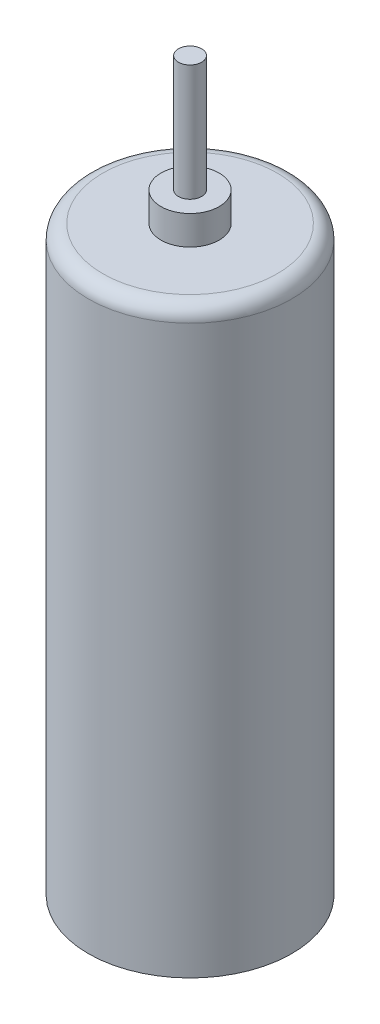
ISO-10303-21;
HEADER;
FILE_DESCRIPTION(('STEP AP214'),'2;1');
FILE_NAME('part.step','',(''),(''),'','','');
FILE_SCHEMA(('AUTOMOTIVE_DESIGN { 1 0 10303 214 1 1 1 1 }'));
ENDSEC;
DATA;
#1=APPLICATION_CONTEXT('core data for automotive mechanical design processes');
#2=APPLICATION_PROTOCOL_DEFINITION('international standard','automotive_design',2000,#1);
#3=PRODUCT_CONTEXT('',#1,'mechanical');
#4=PRODUCT('Part','Part','',(#3));
#5=PRODUCT_RELATED_PRODUCT_CATEGORY('part','',(#4));
#6=PRODUCT_DEFINITION_FORMATION('','',#4);
#7=PRODUCT_DEFINITION_CONTEXT('part definition',#1,'design');
#8=PRODUCT_DEFINITION('design','',#6,#7);
#9=PRODUCT_DEFINITION_SHAPE('','',#8);
#10=(LENGTH_UNIT() NAMED_UNIT(*) SI_UNIT(.MILLI.,.METRE.));
#11=(NAMED_UNIT(*) PLANE_ANGLE_UNIT() SI_UNIT($,.RADIAN.));
#12=(NAMED_UNIT(*) SI_UNIT($,.STERADIAN.) SOLID_ANGLE_UNIT());
#13=UNCERTAINTY_MEASURE_WITH_UNIT(LENGTH_MEASURE(1.E-05),#10,'distance_accuracy_value','');
#14=(GEOMETRIC_REPRESENTATION_CONTEXT(3) GLOBAL_UNCERTAINTY_ASSIGNED_CONTEXT((#13)) GLOBAL_UNIT_ASSIGNED_CONTEXT((#10,
#11,#12)) REPRESENTATION_CONTEXT('',''));
#15=CARTESIAN_POINT('',(0.,0.,0.));
#16=DIRECTION('',(0.,0.,1.));
#17=DIRECTION('',(1.,0.,0.));
#18=AXIS2_PLACEMENT_3D('',#15,#16,#17);
#19=CARTESIAN_POINT('',(0.,20.,0.));
#20=DIRECTION('',(0.,-1.,0.));
#21=DIRECTION('',(0.,0.,-1.));
#22=AXIS2_PLACEMENT_3D('',#19,#20,#21);
#23=CYLINDRICAL_SURFACE('',#22,3.5);
#24=CARTESIAN_POINT('',(0.,19.5,0.));
#25=DIRECTION('',(0.,1.,0.));
#26=DIRECTION('',(0.,0.,1.));
#27=AXIS2_PLACEMENT_3D('',#24,#25,#26);
#28=CIRCLE('',#27,3.5);
#29=CARTESIAN_POINT('',(0.,19.5,3.5));
#30=VERTEX_POINT('',#29);
#31=EDGE_CURVE('E10',#30,#30,#28,.F.);
#32=ORIENTED_EDGE('',*,*,#31,.T.);
#33=EDGE_LOOP('',(#32));
#34=FACE_BOUND('',#33,.T.);
#35=CARTESIAN_POINT('',(0.,0.,0.));
#36=DIRECTION('',(0.,1.,0.));
#37=DIRECTION('',(0.,0.,1.));
#38=AXIS2_PLACEMENT_3D('',#35,#36,#37);
#39=CIRCLE('',#38,3.5);
#40=CARTESIAN_POINT('',(0.,0.,3.5));
#41=VERTEX_POINT('',#40);
#42=EDGE_CURVE('E55',#41,#41,#39,.T.);
#43=ORIENTED_EDGE('',*,*,#42,.T.);
#44=EDGE_LOOP('',(#43));
#45=FACE_BOUND('',#44,.T.);
#46=ADVANCED_FACE('F37',(#34,#45),#23,.T.);
#47=CARTESIAN_POINT('',(0.,20.,0.));
#48=DIRECTION('',(0.,1.,0.));
#49=DIRECTION('',(0.,0.,1.));
#50=AXIS2_PLACEMENT_3D('',#47,#48,#49);
#51=PLANE('',#50);
#52=CARTESIAN_POINT('',(0.,20.,0.));
#53=DIRECTION('',(0.,1.,0.));
#54=DIRECTION('',(0.,0.,1.));
#55=AXIS2_PLACEMENT_3D('',#52,#53,#54);
#56=CIRCLE('',#55,3.);
#57=CARTESIAN_POINT('',(0.,20.,3.));
#58=VERTEX_POINT('',#57);
#59=EDGE_CURVE('E45',#58,#58,#56,.T.);
#60=ORIENTED_EDGE('',*,*,#59,.T.);
#61=EDGE_LOOP('',(#60));
#62=FACE_BOUND('',#61,.T.);
#63=CARTESIAN_POINT('',(0.,20.,0.));
#64=DIRECTION('',(0.,1.,0.));
#65=DIRECTION('',(0.,0.,1.));
#66=AXIS2_PLACEMENT_3D('',#63,#64,#65);
#67=CIRCLE('',#66,1.);
#68=CARTESIAN_POINT('',(0.,20.,1.));
#69=VERTEX_POINT('',#68);
#70=EDGE_CURVE('E50',#69,#69,#67,.T.);
#71=ORIENTED_EDGE('',*,*,#70,.F.);
#72=EDGE_LOOP('',(#71));
#73=FACE_BOUND('',#72,.T.);
#74=ADVANCED_FACE('F91',(#62,#73),#51,.T.);
#75=CARTESIAN_POINT('',(0.,0.,0.));
#76=DIRECTION('',(0.,1.,0.));
#77=DIRECTION('',(0.,0.,1.));
#78=AXIS2_PLACEMENT_3D('',#75,#76,#77);
#79=PLANE('',#78);
#80=ORIENTED_EDGE('',*,*,#42,.F.);
#81=EDGE_LOOP('',(#80));
#82=FACE_BOUND('',#81,.T.);
#83=ADVANCED_FACE('F95',(#82),#79,.F.);
#84=CARTESIAN_POINT('',(0.,21.,0.));
#85=DIRECTION('',(0.,-1.,0.));
#86=DIRECTION('',(0.,0.,-1.));
#87=AXIS2_PLACEMENT_3D('',#84,#85,#86);
#88=CYLINDRICAL_SURFACE('',#87,1.);
#89=CARTESIAN_POINT('',(0.,21.,0.));
#90=DIRECTION('',(0.,1.,0.));
#91=DIRECTION('',(0.,0.,1.));
#92=AXIS2_PLACEMENT_3D('',#89,#90,#91);
#93=CIRCLE('',#92,1.);
#94=CARTESIAN_POINT('',(0.,21.,1.));
#95=VERTEX_POINT('',#94);
#96=EDGE_CURVE('E62',#95,#95,#93,.T.);
#97=ORIENTED_EDGE('',*,*,#96,.F.);
#98=EDGE_LOOP('',(#97));
#99=FACE_BOUND('',#98,.T.);
#100=ORIENTED_EDGE('',*,*,#70,.T.);
#101=EDGE_LOOP('',(#100));
#102=FACE_BOUND('',#101,.T.);
#103=ADVANCED_FACE('F86',(#99,#102),#88,.T.);
#104=CARTESIAN_POINT('',(0.,21.,0.));
#105=DIRECTION('',(0.,1.,0.));
#106=DIRECTION('',(0.,0.,1.));
#107=AXIS2_PLACEMENT_3D('',#104,#105,#106);
#108=PLANE('',#107);
#109=CARTESIAN_POINT('',(0.,21.,0.));
#110=DIRECTION('',(0.,1.,0.));
#111=DIRECTION('',(0.,0.,1.));
#112=AXIS2_PLACEMENT_3D('',#109,#110,#111);
#113=CIRCLE('',#112,0.4);
#114=CARTESIAN_POINT('',(0.,21.,0.4));
#115=VERTEX_POINT('',#114);
#116=EDGE_CURVE('E58',#115,#115,#113,.F.);
#117=ORIENTED_EDGE('',*,*,#116,.T.);
#118=EDGE_LOOP('',(#117));
#119=FACE_BOUND('',#118,.T.);
#120=ORIENTED_EDGE('',*,*,#96,.T.);
#121=EDGE_LOOP('',(#120));
#122=FACE_BOUND('',#121,.T.);
#123=ADVANCED_FACE('F78',(#119,#122),#108,.T.);
#124=CARTESIAN_POINT('',(0.,25.,0.));
#125=DIRECTION('',(0.,-1.,0.));
#126=DIRECTION('',(0.,0.,-1.));
#127=AXIS2_PLACEMENT_3D('',#124,#125,#126);
#128=CYLINDRICAL_SURFACE('',#127,0.4);
#129=ORIENTED_EDGE('',*,*,#116,.F.);
#130=EDGE_LOOP('',(#129));
#131=FACE_BOUND('',#130,.T.);
#132=CARTESIAN_POINT('',(0.,25.,0.));
#133=DIRECTION('',(0.,1.,0.));
#134=DIRECTION('',(0.,0.,1.));
#135=AXIS2_PLACEMENT_3D('',#132,#133,#134);
#136=CIRCLE('',#135,0.4);
#137=CARTESIAN_POINT('',(0.,25.,0.4));
#138=VERTEX_POINT('',#137);
#139=EDGE_CURVE('E63',#138,#138,#136,.T.);
#140=ORIENTED_EDGE('',*,*,#139,.F.);
#141=EDGE_LOOP('',(#140));
#142=FACE_BOUND('',#141,.T.);
#143=ADVANCED_FACE('F76',(#131,#142),#128,.T.);
#144=CARTESIAN_POINT('',(0.,25.,0.));
#145=DIRECTION('',(0.,1.,0.));
#146=DIRECTION('',(0.,0.,1.));
#147=AXIS2_PLACEMENT_3D('',#144,#145,#146);
#148=PLANE('',#147);
#149=ORIENTED_EDGE('',*,*,#139,.T.);
#150=EDGE_LOOP('',(#149));
#151=FACE_BOUND('',#150,.T.);
#152=ADVANCED_FACE('F74',(#151),#148,.T.);
#153=CARTESIAN_POINT('',(0.,19.5,0.));
#154=DIRECTION('',(0.,1.,0.));
#155=DIRECTION('',(0.,0.,1.));
#156=AXIS2_PLACEMENT_3D('',#153,#154,#155);
#157=TOROIDAL_SURFACE('',#156,3.,0.5);
#158=ORIENTED_EDGE('',*,*,#31,.F.);
#159=EDGE_LOOP('',(#158));
#160=FACE_BOUND('',#159,.T.);
#161=ORIENTED_EDGE('',*,*,#59,.F.);
#162=EDGE_LOOP('',(#161));
#163=FACE_BOUND('',#162,.T.);
#164=ADVANCED_FACE('F39',(#160,#163),#157,.T.);
#165=CLOSED_SHELL('',(#46,#74,#83,#103,#123,#143,#152,#164));
#166=MANIFOLD_SOLID_BREP('B2',#165);
#167=ADVANCED_BREP_SHAPE_REPRESENTATION('',(#18,#166),#14);
#168=SHAPE_DEFINITION_REPRESENTATION(#9,#167);
ENDSEC;
END-ISO-10303-21;
